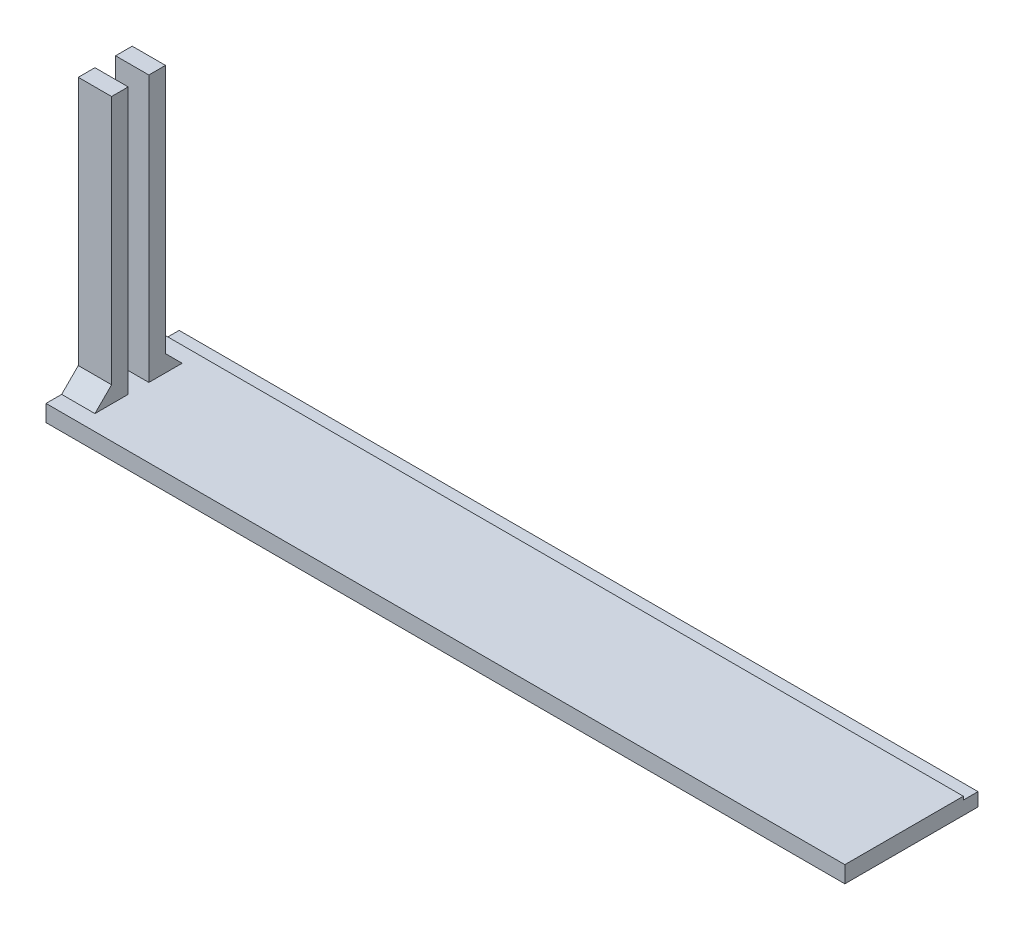
ISO-10303-21;
HEADER;
FILE_DESCRIPTION(('STEP AP214'),'2;1');
FILE_NAME('part.step','',(''),(''),'','','');
FILE_SCHEMA(('AUTOMOTIVE_DESIGN { 1 0 10303 214 1 1 1 1 }'));
ENDSEC;
DATA;
#1=APPLICATION_CONTEXT('core data for automotive mechanical design processes');
#2=APPLICATION_PROTOCOL_DEFINITION('international standard','automotive_design',2000,#1);
#3=PRODUCT_CONTEXT('',#1,'mechanical');
#4=PRODUCT('Part','Part','',(#3));
#5=PRODUCT_RELATED_PRODUCT_CATEGORY('part','',(#4));
#6=PRODUCT_DEFINITION_FORMATION('','',#4);
#7=PRODUCT_DEFINITION_CONTEXT('part definition',#1,'design');
#8=PRODUCT_DEFINITION('design','',#6,#7);
#9=PRODUCT_DEFINITION_SHAPE('','',#8);
#10=(LENGTH_UNIT() NAMED_UNIT(*) SI_UNIT(.MILLI.,.METRE.));
#11=(NAMED_UNIT(*) PLANE_ANGLE_UNIT() SI_UNIT($,.RADIAN.));
#12=(NAMED_UNIT(*) SI_UNIT($,.STERADIAN.) SOLID_ANGLE_UNIT());
#13=UNCERTAINTY_MEASURE_WITH_UNIT(LENGTH_MEASURE(1.E-05),#10,'distance_accuracy_value','');
#14=(GEOMETRIC_REPRESENTATION_CONTEXT(3) GLOBAL_UNCERTAINTY_ASSIGNED_CONTEXT((#13)) GLOBAL_UNIT_ASSIGNED_CONTEXT((#10,
#11,#12)) REPRESENTATION_CONTEXT('',''));
#15=CARTESIAN_POINT('',(0.,0.,0.));
#16=DIRECTION('',(0.,0.,1.));
#17=DIRECTION('',(1.,0.,0.));
#18=AXIS2_PLACEMENT_3D('',#15,#16,#17);
#19=CARTESIAN_POINT('',(0.,3.175,0.));
#20=DIRECTION('',(0.,-1.,0.));
#21=DIRECTION('',(0.,0.,-1.));
#22=AXIS2_PLACEMENT_3D('',#19,#20,#21);
#23=PLANE('',#22);
#24=DIRECTION('',(0.,0.,-1.));
#25=VECTOR('',#24,1.);
#26=CARTESIAN_POINT('',(-146.05,3.175,-13.2715));
#27=LINE('',#26,#25);
#28=CARTESIAN_POINT('',(-146.05,3.175,-13.2715));
#29=VERTEX_POINT('',#28);
#30=CARTESIAN_POINT('',(-146.05,3.175,-19.6215));
#31=VERTEX_POINT('',#30);
#32=EDGE_CURVE('E157',#29,#31,#27,.T.);
#33=ORIENTED_EDGE('',*,*,#32,.F.);
#34=DIRECTION('',(-1.,0.,0.));
#35=VECTOR('',#34,1.);
#36=CARTESIAN_POINT('',(-146.05,3.175,-13.2715));
#37=LINE('',#36,#35);
#38=CARTESIAN_POINT('',(-152.4,3.175,-13.2715));
#39=VERTEX_POINT('',#38);
#40=EDGE_CURVE('E168',#29,#39,#37,.T.);
#41=ORIENTED_EDGE('',*,*,#40,.T.);
#42=DIRECTION('',(0.,0.,-1.));
#43=VECTOR('',#42,1.);
#44=CARTESIAN_POINT('',(-152.4,3.175,0.));
#45=LINE('',#44,#43);
#46=CARTESIAN_POINT('',(-152.4,3.175,-9.3345));
#47=VERTEX_POINT('',#46);
#48=EDGE_CURVE('E239',#47,#39,#45,.T.);
#49=ORIENTED_EDGE('',*,*,#48,.F.);
#50=DIRECTION('',(-1.,0.,0.));
#51=VECTOR('',#50,1.);
#52=CARTESIAN_POINT('',(-146.05,3.175,-9.3345));
#53=LINE('',#52,#51);
#54=CARTESIAN_POINT('',(-146.05,3.175,-9.3345));
#55=VERTEX_POINT('',#54);
#56=EDGE_CURVE('E196',#55,#47,#53,.T.);
#57=ORIENTED_EDGE('',*,*,#56,.F.);
#58=DIRECTION('',(0.,0.,-1.));
#59=VECTOR('',#58,1.);
#60=CARTESIAN_POINT('',(-146.05,3.175,-6.1595));
#61=LINE('',#60,#59);
#62=CARTESIAN_POINT('',(-146.05,3.175,-2.98450000000002));
#63=VERTEX_POINT('',#62);
#64=EDGE_CURVE('E188',#63,#55,#61,.T.);
#65=ORIENTED_EDGE('',*,*,#64,.F.);
#66=DIRECTION('',(1.,0.,0.));
#67=VECTOR('',#66,1.);
#68=CARTESIAN_POINT('',(0.,3.175,-2.98450000000002));
#69=LINE('',#68,#67);
#70=CARTESIAN_POINT('',(-152.4,3.175,-2.98450000000002));
#71=VERTEX_POINT('',#70);
#72=EDGE_CURVE('E260',#71,#63,#69,.T.);
#73=ORIENTED_EDGE('',*,*,#72,.F.);
#74=CARTESIAN_POINT('',(-152.4,3.175,0.));
#75=VERTEX_POINT('',#74);
#76=EDGE_CURVE('E235',#75,#71,#45,.T.);
#77=ORIENTED_EDGE('',*,*,#76,.F.);
#78=DIRECTION('',(-1.,0.,0.));
#79=VECTOR('',#78,1.);
#80=CARTESIAN_POINT('',(0.,3.175,0.));
#81=LINE('',#80,#79);
#82=CARTESIAN_POINT('',(0.,3.175,0.));
#83=VERTEX_POINT('',#82);
#84=EDGE_CURVE('E230',#83,#75,#81,.T.);
#85=ORIENTED_EDGE('',*,*,#84,.F.);
#86=DIRECTION('',(0.,0.,1.));
#87=VECTOR('',#86,1.);
#88=CARTESIAN_POINT('',(0.,3.175,0.));
#89=LINE('',#88,#87);
#90=CARTESIAN_POINT('',(0.,3.175,-22.606));
#91=VERTEX_POINT('',#90);
#92=EDGE_CURVE('E227',#91,#83,#89,.T.);
#93=ORIENTED_EDGE('',*,*,#92,.F.);
#94=DIRECTION('',(-1.,0.,0.));
#95=VECTOR('',#94,1.);
#96=CARTESIAN_POINT('',(0.,3.175,-22.606));
#97=LINE('',#96,#95);
#98=CARTESIAN_POINT('',(-152.4,3.175,-22.606));
#99=VERTEX_POINT('',#98);
#100=EDGE_CURVE('E205',#91,#99,#97,.T.);
#101=ORIENTED_EDGE('',*,*,#100,.T.);
#102=CARTESIAN_POINT('',(-152.4,3.175,-19.6215));
#103=VERTEX_POINT('',#102);
#104=EDGE_CURVE('E234',#103,#99,#45,.T.);
#105=ORIENTED_EDGE('',*,*,#104,.F.);
#106=DIRECTION('',(-1.,0.,0.));
#107=VECTOR('',#106,1.);
#108=CARTESIAN_POINT('',(0.,3.175,-19.6215));
#109=LINE('',#108,#107);
#110=EDGE_CURVE('E262',#31,#103,#109,.T.);
#111=ORIENTED_EDGE('',*,*,#110,.F.);
#112=EDGE_LOOP('',(#33,#41,#49,#57,#65,#73,#77,#85,#93,#101,#105,#111));
#113=FACE_BOUND('',#112,.T.);
#114=ADVANCED_FACE('F39',(#113),#23,.F.);
#115=CARTESIAN_POINT('',(0.,3.175,-25.4));
#116=DIRECTION('',(0.,0.,1.));
#117=DIRECTION('',(-1.,0.,0.));
#118=AXIS2_PLACEMENT_3D('',#115,#116,#117);
#119=PLANE('',#118);
#120=DIRECTION('',(1.,0.,0.));
#121=VECTOR('',#120,1.);
#122=CARTESIAN_POINT('',(0.,2.54,-25.4));
#123=LINE('',#122,#121);
#124=CARTESIAN_POINT('',(-152.4,2.54,-25.4));
#125=VERTEX_POINT('',#124);
#126=CARTESIAN_POINT('',(0.,2.54,-25.4));
#127=VERTEX_POINT('',#126);
#128=EDGE_CURVE('E217',#125,#127,#123,.T.);
#129=ORIENTED_EDGE('',*,*,#128,.T.);
#130=DIRECTION('',(0.,-1.,0.));
#131=VECTOR('',#130,1.);
#132=CARTESIAN_POINT('',(0.,3.175,-25.4));
#133=LINE('',#132,#131);
#134=CARTESIAN_POINT('',(0.,0.,-25.4));
#135=VERTEX_POINT('',#134);
#136=EDGE_CURVE('E238',#127,#135,#133,.T.);
#137=ORIENTED_EDGE('',*,*,#136,.T.);
#138=DIRECTION('',(1.,0.,0.));
#139=VECTOR('',#138,1.);
#140=CARTESIAN_POINT('',(0.,0.,-25.4));
#141=LINE('',#140,#139);
#142=CARTESIAN_POINT('',(-152.4,0.,-25.4));
#143=VERTEX_POINT('',#142);
#144=EDGE_CURVE('E231',#143,#135,#141,.T.);
#145=ORIENTED_EDGE('',*,*,#144,.F.);
#146=DIRECTION('',(0.,-1.,0.));
#147=VECTOR('',#146,1.);
#148=CARTESIAN_POINT('',(-152.4,3.175,-25.4));
#149=LINE('',#148,#147);
#150=EDGE_CURVE('E251',#125,#143,#149,.T.);
#151=ORIENTED_EDGE('',*,*,#150,.F.);
#152=EDGE_LOOP('',(#129,#137,#145,#151));
#153=FACE_BOUND('',#152,.T.);
#154=ADVANCED_FACE('F316',(#153),#119,.F.);
#155=CARTESIAN_POINT('',(0.,3.175,0.));
#156=DIRECTION('',(-1.,0.,0.));
#157=DIRECTION('',(0.,0.,-1.));
#158=AXIS2_PLACEMENT_3D('',#155,#156,#157);
#159=PLANE('',#158);
#160=ORIENTED_EDGE('',*,*,#92,.T.);
#161=DIRECTION('',(0.,-1.,0.));
#162=VECTOR('',#161,1.);
#163=CARTESIAN_POINT('',(0.,3.175,0.));
#164=LINE('',#163,#162);
#165=CARTESIAN_POINT('',(0.,0.,0.));
#166=VERTEX_POINT('',#165);
#167=EDGE_CURVE('E257',#83,#166,#164,.T.);
#168=ORIENTED_EDGE('',*,*,#167,.T.);
#169=DIRECTION('',(0.,0.,1.));
#170=VECTOR('',#169,1.);
#171=CARTESIAN_POINT('',(0.,0.,0.));
#172=LINE('',#171,#170);
#173=EDGE_CURVE('E225',#135,#166,#172,.T.);
#174=ORIENTED_EDGE('',*,*,#173,.F.);
#175=ORIENTED_EDGE('',*,*,#136,.F.);
#176=DIRECTION('',(0.,0.,1.));
#177=VECTOR('',#176,1.);
#178=CARTESIAN_POINT('',(0.,2.54,-25.4));
#179=LINE('',#178,#177);
#180=CARTESIAN_POINT('',(0.,2.54,-22.606));
#181=VERTEX_POINT('',#180);
#182=EDGE_CURVE('E210',#127,#181,#179,.T.);
#183=ORIENTED_EDGE('',*,*,#182,.T.);
#184=DIRECTION('',(0.,1.,0.));
#185=VECTOR('',#184,1.);
#186=CARTESIAN_POINT('',(0.,2.54,-22.606));
#187=LINE('',#186,#185);
#188=EDGE_CURVE('E220',#181,#91,#187,.T.);
#189=ORIENTED_EDGE('',*,*,#188,.T.);
#190=EDGE_LOOP('',(#160,#168,#174,#175,#183,#189));
#191=FACE_BOUND('',#190,.T.);
#192=ADVANCED_FACE('F322',(#191),#159,.F.);
#193=CARTESIAN_POINT('',(0.,3.175,0.));
#194=DIRECTION('',(0.,0.,-1.));
#195=DIRECTION('',(1.,0.,0.));
#196=AXIS2_PLACEMENT_3D('',#193,#194,#195);
#197=PLANE('',#196);
#198=DIRECTION('',(-1.,0.,0.));
#199=VECTOR('',#198,1.);
#200=CARTESIAN_POINT('',(0.,0.,0.));
#201=LINE('',#200,#199);
#202=CARTESIAN_POINT('',(-152.4,0.,0.));
#203=VERTEX_POINT('',#202);
#204=EDGE_CURVE('E242',#166,#203,#201,.T.);
#205=ORIENTED_EDGE('',*,*,#204,.F.);
#206=ORIENTED_EDGE('',*,*,#167,.F.);
#207=ORIENTED_EDGE('',*,*,#84,.T.);
#208=DIRECTION('',(0.,-1.,0.));
#209=VECTOR('',#208,1.);
#210=CARTESIAN_POINT('',(-152.4,3.175,0.));
#211=LINE('',#210,#209);
#212=EDGE_CURVE('E254',#75,#203,#211,.T.);
#213=ORIENTED_EDGE('',*,*,#212,.T.);
#214=EDGE_LOOP('',(#205,#206,#207,#213));
#215=FACE_BOUND('',#214,.T.);
#216=ADVANCED_FACE('F320',(#215),#197,.F.);
#217=CARTESIAN_POINT('',(-152.4,3.175,0.));
#218=DIRECTION('',(1.,0.,0.));
#219=DIRECTION('',(0.,0.,1.));
#220=AXIS2_PLACEMENT_3D('',#217,#218,#219);
#221=PLANE('',#220);
#222=DIRECTION('',(0.,0.,-1.));
#223=VECTOR('',#222,1.);
#224=CARTESIAN_POINT('',(-152.4,2.54,-25.4));
#225=LINE('',#224,#223);
#226=CARTESIAN_POINT('',(-152.4,2.54,-22.606));
#227=VERTEX_POINT('',#226);
#228=EDGE_CURVE('E215',#227,#125,#225,.T.);
#229=ORIENTED_EDGE('',*,*,#228,.T.);
#230=ORIENTED_EDGE('',*,*,#150,.T.);
#231=DIRECTION('',(0.,0.,-1.));
#232=VECTOR('',#231,1.);
#233=CARTESIAN_POINT('',(-152.4,0.,0.));
#234=LINE('',#233,#232);
#235=EDGE_CURVE('E245',#203,#143,#234,.T.);
#236=ORIENTED_EDGE('',*,*,#235,.F.);
#237=ORIENTED_EDGE('',*,*,#212,.F.);
#238=ORIENTED_EDGE('',*,*,#76,.T.);
#239=DIRECTION('',(0.,-0.707106781186552,0.707106781186543));
#240=VECTOR('',#239,1.);
#241=CARTESIAN_POINT('',(-152.4,1.68274999999999,-1.49225000000003));
#242=LINE('',#241,#240);
#243=CARTESIAN_POINT('',(-152.4,6.35000000000002,-6.1595));
#244=VERTEX_POINT('',#243);
#245=EDGE_CURVE('E47',#244,#71,#242,.T.);
#246=ORIENTED_EDGE('',*,*,#245,.F.);
#247=DIRECTION('',(0.,-1.,0.));
#248=VECTOR('',#247,1.);
#249=CARTESIAN_POINT('',(-152.4,3.175,-6.1595));
#250=LINE('',#249,#248);
#251=CARTESIAN_POINT('',(-152.4,53.975,-6.1595));
#252=VERTEX_POINT('',#251);
#253=EDGE_CURVE('E183',#252,#244,#250,.T.);
#254=ORIENTED_EDGE('',*,*,#253,.F.);
#255=DIRECTION('',(0.,0.,1.));
#256=VECTOR('',#255,1.);
#257=CARTESIAN_POINT('',(-152.4,53.975,-6.1595));
#258=LINE('',#257,#256);
#259=CARTESIAN_POINT('',(-152.4,53.975,-9.3345));
#260=VERTEX_POINT('',#259);
#261=EDGE_CURVE('E189',#260,#252,#258,.T.);
#262=ORIENTED_EDGE('',*,*,#261,.F.);
#263=DIRECTION('',(0.,1.,0.));
#264=VECTOR('',#263,1.);
#265=CARTESIAN_POINT('',(-152.4,3.175,-9.3345));
#266=LINE('',#265,#264);
#267=EDGE_CURVE('E198',#47,#260,#266,.T.);
#268=ORIENTED_EDGE('',*,*,#267,.F.);
#269=ORIENTED_EDGE('',*,*,#48,.T.);
#270=DIRECTION('',(0.,-1.,0.));
#271=VECTOR('',#270,1.);
#272=CARTESIAN_POINT('',(-152.4,3.175,-13.2715));
#273=LINE('',#272,#271);
#274=CARTESIAN_POINT('',(-152.4,53.975,-13.2715));
#275=VERTEX_POINT('',#274);
#276=EDGE_CURVE('E177',#275,#39,#273,.T.);
#277=ORIENTED_EDGE('',*,*,#276,.F.);
#278=DIRECTION('',(0.,0.,1.));
#279=VECTOR('',#278,1.);
#280=CARTESIAN_POINT('',(-152.4,53.975,-13.2715));
#281=LINE('',#280,#279);
#282=CARTESIAN_POINT('',(-152.4,53.975,-16.4465));
#283=VERTEX_POINT('',#282);
#284=EDGE_CURVE('E180',#283,#275,#281,.T.);
#285=ORIENTED_EDGE('',*,*,#284,.F.);
#286=DIRECTION('',(0.,1.,0.));
#287=VECTOR('',#286,1.);
#288=CARTESIAN_POINT('',(-152.4,3.175,-16.4465));
#289=LINE('',#288,#287);
#290=CARTESIAN_POINT('',(-152.4,6.35,-16.4465));
#291=VERTEX_POINT('',#290);
#292=EDGE_CURVE('E163',#291,#283,#289,.T.);
#293=ORIENTED_EDGE('',*,*,#292,.F.);
#294=DIRECTION('',(0.,0.707106781186544,0.707106781186551));
#295=VECTOR('',#294,1.);
#296=CARTESIAN_POINT('',(-152.4,12.98575,-9.81074999999993));
#297=LINE('',#296,#295);
#298=EDGE_CURVE('E268',#103,#291,#297,.T.);
#299=ORIENTED_EDGE('',*,*,#298,.F.);
#300=ORIENTED_EDGE('',*,*,#104,.T.);
#301=DIRECTION('',(0.,1.,0.));
#302=VECTOR('',#301,1.);
#303=CARTESIAN_POINT('',(-152.4,2.54,-22.606));
#304=LINE('',#303,#302);
#305=EDGE_CURVE('E223',#227,#99,#304,.T.);
#306=ORIENTED_EDGE('',*,*,#305,.F.);
#307=EDGE_LOOP('',(#229,#230,#236,#237,#238,#246,#254,#262,#268,#269,#277,#285,#293,#299,#300,#306));
#308=FACE_BOUND('',#307,.T.);
#309=ADVANCED_FACE('F277',(#308),#221,.F.);
#310=CARTESIAN_POINT('',(0.,0.,0.));
#311=DIRECTION('',(0.,-1.,0.));
#312=DIRECTION('',(0.,0.,-1.));
#313=AXIS2_PLACEMENT_3D('',#310,#311,#312);
#314=PLANE('',#313);
#315=ORIENTED_EDGE('',*,*,#173,.T.);
#316=ORIENTED_EDGE('',*,*,#204,.T.);
#317=ORIENTED_EDGE('',*,*,#235,.T.);
#318=ORIENTED_EDGE('',*,*,#144,.T.);
#319=EDGE_LOOP('',(#315,#316,#317,#318));
#320=FACE_BOUND('',#319,.T.);
#321=ADVANCED_FACE('F318',(#320),#314,.T.);
#322=CARTESIAN_POINT('',(0.,2.54,-22.606));
#323=DIRECTION('',(0.,0.,1.));
#324=DIRECTION('',(-1.,0.,0.));
#325=AXIS2_PLACEMENT_3D('',#322,#323,#324);
#326=PLANE('',#325);
#327=ORIENTED_EDGE('',*,*,#100,.F.);
#328=ORIENTED_EDGE('',*,*,#188,.F.);
#329=DIRECTION('',(-1.,0.,0.));
#330=VECTOR('',#329,1.);
#331=CARTESIAN_POINT('',(0.,2.54,-22.606));
#332=LINE('',#331,#330);
#333=EDGE_CURVE('E213',#181,#227,#332,.T.);
#334=ORIENTED_EDGE('',*,*,#333,.T.);
#335=ORIENTED_EDGE('',*,*,#305,.T.);
#336=EDGE_LOOP('',(#327,#328,#334,#335));
#337=FACE_BOUND('',#336,.T.);
#338=ADVANCED_FACE('F308',(#337),#326,.F.);
#339=CARTESIAN_POINT('',(0.,2.54,0.));
#340=DIRECTION('',(0.,1.,0.));
#341=DIRECTION('',(0.,0.,1.));
#342=AXIS2_PLACEMENT_3D('',#339,#340,#341);
#343=PLANE('',#342);
#344=ORIENTED_EDGE('',*,*,#182,.F.);
#345=ORIENTED_EDGE('',*,*,#128,.F.);
#346=ORIENTED_EDGE('',*,*,#228,.F.);
#347=ORIENTED_EDGE('',*,*,#333,.F.);
#348=EDGE_LOOP('',(#344,#345,#346,#347));
#349=FACE_BOUND('',#348,.T.);
#350=ADVANCED_FACE('F310',(#349),#343,.T.);
#351=CARTESIAN_POINT('',(-146.05,3.175,-6.1595));
#352=DIRECTION('',(0.,0.,1.));
#353=DIRECTION('',(0.,-1.,0.));
#354=AXIS2_PLACEMENT_3D('',#351,#352,#353);
#355=PLANE('',#354);
#356=DIRECTION('',(0.,-1.,0.));
#357=VECTOR('',#356,1.);
#358=CARTESIAN_POINT('',(-146.05,3.175,-6.1595));
#359=LINE('',#358,#357);
#360=CARTESIAN_POINT('',(-146.05,53.975,-6.1595));
#361=VERTEX_POINT('',#360);
#362=CARTESIAN_POINT('',(-146.05,6.35000000000002,-6.1595));
#363=VERTEX_POINT('',#362);
#364=EDGE_CURVE('E185',#361,#363,#359,.T.);
#365=ORIENTED_EDGE('',*,*,#364,.F.);
#366=DIRECTION('',(-1.,0.,0.));
#367=VECTOR('',#366,1.);
#368=CARTESIAN_POINT('',(-146.05,53.975,-6.1595));
#369=LINE('',#368,#367);
#370=EDGE_CURVE('E203',#361,#252,#369,.T.);
#371=ORIENTED_EDGE('',*,*,#370,.T.);
#372=ORIENTED_EDGE('',*,*,#253,.T.);
#373=DIRECTION('',(-1.,0.,0.));
#374=VECTOR('',#373,1.);
#375=CARTESIAN_POINT('',(-146.05,6.35000000000002,-6.1595));
#376=LINE('',#375,#374);
#377=EDGE_CURVE('E56',#363,#244,#376,.T.);
#378=ORIENTED_EDGE('',*,*,#377,.F.);
#379=EDGE_LOOP('',(#365,#371,#372,#378));
#380=FACE_BOUND('',#379,.T.);
#381=ADVANCED_FACE('F290',(#380),#355,.T.);
#382=CARTESIAN_POINT('',(-146.05,53.975,-6.1595));
#383=DIRECTION('',(0.,1.,0.));
#384=DIRECTION('',(0.,0.,1.));
#385=AXIS2_PLACEMENT_3D('',#382,#383,#384);
#386=PLANE('',#385);
#387=ORIENTED_EDGE('',*,*,#261,.T.);
#388=ORIENTED_EDGE('',*,*,#370,.F.);
#389=DIRECTION('',(0.,0.,1.));
#390=VECTOR('',#389,1.);
#391=CARTESIAN_POINT('',(-146.05,53.975,-6.1595));
#392=LINE('',#391,#390);
#393=CARTESIAN_POINT('',(-146.05,53.975,-9.3345));
#394=VERTEX_POINT('',#393);
#395=EDGE_CURVE('E194',#394,#361,#392,.T.);
#396=ORIENTED_EDGE('',*,*,#395,.F.);
#397=DIRECTION('',(-1.,0.,0.));
#398=VECTOR('',#397,1.);
#399=CARTESIAN_POINT('',(-146.05,53.975,-9.3345));
#400=LINE('',#399,#398);
#401=EDGE_CURVE('E206',#394,#260,#400,.T.);
#402=ORIENTED_EDGE('',*,*,#401,.T.);
#403=EDGE_LOOP('',(#387,#388,#396,#402));
#404=FACE_BOUND('',#403,.T.);
#405=ADVANCED_FACE('F294',(#404),#386,.T.);
#406=CARTESIAN_POINT('',(-146.05,3.175,-9.3345));
#407=DIRECTION('',(0.,0.,-1.));
#408=DIRECTION('',(1.,0.,0.));
#409=AXIS2_PLACEMENT_3D('',#406,#407,#408);
#410=PLANE('',#409);
#411=ORIENTED_EDGE('',*,*,#267,.T.);
#412=ORIENTED_EDGE('',*,*,#401,.F.);
#413=DIRECTION('',(0.,1.,0.));
#414=VECTOR('',#413,1.);
#415=CARTESIAN_POINT('',(-146.05,3.175,-9.3345));
#416=LINE('',#415,#414);
#417=EDGE_CURVE('E192',#55,#394,#416,.T.);
#418=ORIENTED_EDGE('',*,*,#417,.F.);
#419=ORIENTED_EDGE('',*,*,#56,.T.);
#420=EDGE_LOOP('',(#411,#412,#418,#419));
#421=FACE_BOUND('',#420,.T.);
#422=ADVANCED_FACE('F296',(#421),#410,.T.);
#423=CARTESIAN_POINT('',(-146.05,0.,0.));
#424=DIRECTION('',(1.,0.,0.));
#425=DIRECTION('',(0.,0.,1.));
#426=AXIS2_PLACEMENT_3D('',#423,#424,#425);
#427=PLANE('',#426);
#428=ORIENTED_EDGE('',*,*,#364,.T.);
#429=DIRECTION('',(0.,0.707106781186552,-0.707106781186543));
#430=VECTOR('',#429,1.);
#431=CARTESIAN_POINT('',(-146.05,6.35000000000002,-6.1595));
#432=LINE('',#431,#430);
#433=EDGE_CURVE('E11',#63,#363,#432,.T.);
#434=ORIENTED_EDGE('',*,*,#433,.F.);
#435=ORIENTED_EDGE('',*,*,#64,.T.);
#436=ORIENTED_EDGE('',*,*,#417,.T.);
#437=ORIENTED_EDGE('',*,*,#395,.T.);
#438=EDGE_LOOP('',(#428,#434,#435,#436,#437));
#439=FACE_BOUND('',#438,.T.);
#440=ADVANCED_FACE('F284',(#439),#427,.T.);
#441=CARTESIAN_POINT('',(-146.05,3.175,-13.2715));
#442=DIRECTION('',(0.,0.,1.));
#443=DIRECTION('',(-1.,0.,0.));
#444=AXIS2_PLACEMENT_3D('',#441,#442,#443);
#445=PLANE('',#444);
#446=ORIENTED_EDGE('',*,*,#276,.T.);
#447=ORIENTED_EDGE('',*,*,#40,.F.);
#448=DIRECTION('',(0.,-1.,0.));
#449=VECTOR('',#448,1.);
#450=CARTESIAN_POINT('',(-146.05,3.175,-13.2715));
#451=LINE('',#450,#449);
#452=CARTESIAN_POINT('',(-146.05,53.975,-13.2715));
#453=VERTEX_POINT('',#452);
#454=EDGE_CURVE('E182',#453,#29,#451,.T.);
#455=ORIENTED_EDGE('',*,*,#454,.F.);
#456=DIRECTION('',(-1.,0.,0.));
#457=VECTOR('',#456,1.);
#458=CARTESIAN_POINT('',(-146.05,53.975,-13.2715));
#459=LINE('',#458,#457);
#460=EDGE_CURVE('E167',#453,#275,#459,.T.);
#461=ORIENTED_EDGE('',*,*,#460,.T.);
#462=EDGE_LOOP('',(#446,#447,#455,#461));
#463=FACE_BOUND('',#462,.T.);
#464=ADVANCED_FACE('F383',(#463),#445,.T.);
#465=CARTESIAN_POINT('',(-146.05,53.975,-13.2715));
#466=DIRECTION('',(0.,1.,0.));
#467=DIRECTION('',(0.,0.,1.));
#468=AXIS2_PLACEMENT_3D('',#465,#466,#467);
#469=PLANE('',#468);
#470=ORIENTED_EDGE('',*,*,#284,.T.);
#471=ORIENTED_EDGE('',*,*,#460,.F.);
#472=DIRECTION('',(0.,0.,1.));
#473=VECTOR('',#472,1.);
#474=CARTESIAN_POINT('',(-146.05,53.975,-13.2715));
#475=LINE('',#474,#473);
#476=CARTESIAN_POINT('',(-146.05,53.975,-16.4465));
#477=VERTEX_POINT('',#476);
#478=EDGE_CURVE('E151',#477,#453,#475,.T.);
#479=ORIENTED_EDGE('',*,*,#478,.F.);
#480=DIRECTION('',(-1.,0.,0.));
#481=VECTOR('',#480,1.);
#482=CARTESIAN_POINT('',(-146.05,53.975,-16.4465));
#483=LINE('',#482,#481);
#484=EDGE_CURVE('E160',#477,#283,#483,.T.);
#485=ORIENTED_EDGE('',*,*,#484,.T.);
#486=EDGE_LOOP('',(#470,#471,#479,#485));
#487=FACE_BOUND('',#486,.T.);
#488=ADVANCED_FACE('F170',(#487),#469,.T.);
#489=CARTESIAN_POINT('',(-146.05,3.175,-16.4465));
#490=DIRECTION('',(0.,0.,-1.));
#491=DIRECTION('',(0.,1.,0.));
#492=AXIS2_PLACEMENT_3D('',#489,#490,#491);
#493=PLANE('',#492);
#494=ORIENTED_EDGE('',*,*,#292,.T.);
#495=ORIENTED_EDGE('',*,*,#484,.F.);
#496=DIRECTION('',(0.,1.,0.));
#497=VECTOR('',#496,1.);
#498=CARTESIAN_POINT('',(-146.05,3.175,-16.4465));
#499=LINE('',#498,#497);
#500=CARTESIAN_POINT('',(-146.05,6.35,-16.4465));
#501=VERTEX_POINT('',#500);
#502=EDGE_CURVE('E147',#501,#477,#499,.T.);
#503=ORIENTED_EDGE('',*,*,#502,.F.);
#504=DIRECTION('',(1.,0.,0.));
#505=VECTOR('',#504,1.);
#506=CARTESIAN_POINT('',(-146.05,6.35,-16.4465));
#507=LINE('',#506,#505);
#508=EDGE_CURVE('E265',#291,#501,#507,.T.);
#509=ORIENTED_EDGE('',*,*,#508,.F.);
#510=EDGE_LOOP('',(#494,#495,#503,#509));
#511=FACE_BOUND('',#510,.T.);
#512=ADVANCED_FACE('F161',(#511),#493,.T.);
#513=CARTESIAN_POINT('',(-146.05,0.,0.));
#514=DIRECTION('',(1.,0.,0.));
#515=DIRECTION('',(0.,0.,1.));
#516=AXIS2_PLACEMENT_3D('',#513,#514,#515);
#517=PLANE('',#516);
#518=ORIENTED_EDGE('',*,*,#454,.T.);
#519=ORIENTED_EDGE('',*,*,#32,.T.);
#520=DIRECTION('',(0.,-0.707106781186544,-0.707106781186551));
#521=VECTOR('',#520,1.);
#522=CARTESIAN_POINT('',(-146.05,3.175,-19.6215));
#523=LINE('',#522,#521);
#524=EDGE_CURVE('E154',#501,#31,#523,.T.);
#525=ORIENTED_EDGE('',*,*,#524,.F.);
#526=ORIENTED_EDGE('',*,*,#502,.T.);
#527=ORIENTED_EDGE('',*,*,#478,.T.);
#528=EDGE_LOOP('',(#518,#519,#525,#526,#527));
#529=FACE_BOUND('',#528,.T.);
#530=ADVANCED_FACE('F149',(#529),#517,.T.);
#531=CARTESIAN_POINT('',(0.,3.175,-19.6215));
#532=DIRECTION('',(0.,-0.707106781186551,0.707106781186544));
#533=DIRECTION('',(-1.,0.,0.));
#534=AXIS2_PLACEMENT_3D('',#531,#532,#533);
#535=PLANE('',#534);
#536=ORIENTED_EDGE('',*,*,#524,.T.);
#537=ORIENTED_EDGE('',*,*,#110,.T.);
#538=ORIENTED_EDGE('',*,*,#298,.T.);
#539=ORIENTED_EDGE('',*,*,#508,.T.);
#540=EDGE_LOOP('',(#536,#537,#538,#539));
#541=FACE_BOUND('',#540,.T.);
#542=ADVANCED_FACE('F409',(#541),#535,.F.);
#543=CARTESIAN_POINT('',(-146.05,6.35000000000002,-6.1595));
#544=DIRECTION('',(0.,-0.707106781186543,-0.707106781186552));
#545=DIRECTION('',(-1.,0.,0.));
#546=AXIS2_PLACEMENT_3D('',#543,#544,#545);
#547=PLANE('',#546);
#548=ORIENTED_EDGE('',*,*,#433,.T.);
#549=ORIENTED_EDGE('',*,*,#377,.T.);
#550=ORIENTED_EDGE('',*,*,#245,.T.);
#551=ORIENTED_EDGE('',*,*,#72,.T.);
#552=EDGE_LOOP('',(#548,#549,#550,#551));
#553=FACE_BOUND('',#552,.T.);
#554=ADVANCED_FACE('F41',(#553),#547,.F.);
#555=CLOSED_SHELL('',(#114,#154,#192,#216,#309,#321,#338,#350,#381,#405,#422,#440,#464,#488,
#512,#530,#542,#554));
#556=MANIFOLD_SOLID_BREP('B2',#555);
#557=ADVANCED_BREP_SHAPE_REPRESENTATION('',(#18,#556),#14);
#558=SHAPE_DEFINITION_REPRESENTATION(#9,#557);
ENDSEC;
END-ISO-10303-21;
